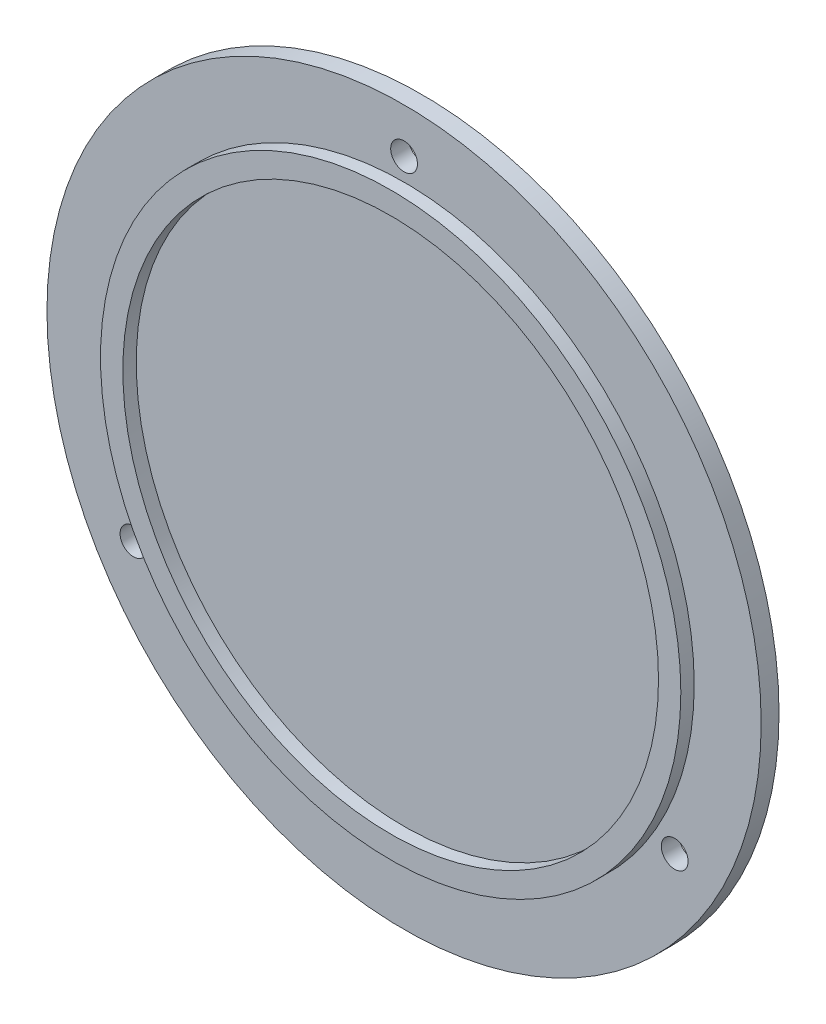
ISO-10303-21;
HEADER;
FILE_DESCRIPTION(('STEP AP214'),'2;1');
FILE_NAME('part.step','',(''),(''),'','','');
FILE_SCHEMA(('AUTOMOTIVE_DESIGN { 1 0 10303 214 1 1 1 1 }'));
ENDSEC;
DATA;
#1=APPLICATION_CONTEXT('core data for automotive mechanical design processes');
#2=APPLICATION_PROTOCOL_DEFINITION('international standard','automotive_design',2000,#1);
#3=PRODUCT_CONTEXT('',#1,'mechanical');
#4=PRODUCT('Part','Part','',(#3));
#5=PRODUCT_RELATED_PRODUCT_CATEGORY('part','',(#4));
#6=PRODUCT_DEFINITION_FORMATION('','',#4);
#7=PRODUCT_DEFINITION_CONTEXT('part definition',#1,'design');
#8=PRODUCT_DEFINITION('design','',#6,#7);
#9=PRODUCT_DEFINITION_SHAPE('','',#8);
#10=(LENGTH_UNIT() NAMED_UNIT(*) SI_UNIT(.MILLI.,.METRE.));
#11=(NAMED_UNIT(*) PLANE_ANGLE_UNIT() SI_UNIT($,.RADIAN.));
#12=(NAMED_UNIT(*) SI_UNIT($,.STERADIAN.) SOLID_ANGLE_UNIT());
#13=UNCERTAINTY_MEASURE_WITH_UNIT(LENGTH_MEASURE(1.E-05),#10,'distance_accuracy_value','');
#14=(GEOMETRIC_REPRESENTATION_CONTEXT(3) GLOBAL_UNCERTAINTY_ASSIGNED_CONTEXT((#13)) GLOBAL_UNIT_ASSIGNED_CONTEXT((#10,
#11,#12)) REPRESENTATION_CONTEXT('',''));
#15=CARTESIAN_POINT('',(0.,0.,0.));
#16=DIRECTION('',(0.,0.,1.));
#17=DIRECTION('',(1.,0.,0.));
#18=AXIS2_PLACEMENT_3D('',#15,#16,#17);
#19=CARTESIAN_POINT('',(0.,0.,4.));
#20=DIRECTION('',(0.,0.,-1.));
#21=DIRECTION('',(-1.,0.,0.));
#22=AXIS2_PLACEMENT_3D('',#19,#20,#21);
#23=CYLINDRICAL_SURFACE('',#22,80.);
#24=CARTESIAN_POINT('',(0.,0.,4.));
#25=DIRECTION('',(0.,0.,1.));
#26=DIRECTION('',(1.,0.,0.));
#27=AXIS2_PLACEMENT_3D('',#24,#25,#26);
#28=CIRCLE('',#27,80.);
#29=CARTESIAN_POINT('',(80.,0.,4.));
#30=VERTEX_POINT('',#29);
#31=EDGE_CURVE('E44',#30,#30,#28,.T.);
#32=ORIENTED_EDGE('',*,*,#31,.F.);
#33=EDGE_LOOP('',(#32));
#34=FACE_BOUND('',#33,.T.);
#35=CARTESIAN_POINT('',(0.,0.,0.));
#36=DIRECTION('',(0.,0.,1.));
#37=DIRECTION('',(1.,0.,0.));
#38=AXIS2_PLACEMENT_3D('',#35,#36,#37);
#39=CIRCLE('',#38,80.);
#40=CARTESIAN_POINT('',(80.,0.,0.));
#41=VERTEX_POINT('',#40);
#42=EDGE_CURVE('E49',#41,#41,#39,.T.);
#43=ORIENTED_EDGE('',*,*,#42,.T.);
#44=EDGE_LOOP('',(#43));
#45=FACE_BOUND('',#44,.T.);
#46=ADVANCED_FACE('F37',(#34,#45),#23,.T.);
#47=CARTESIAN_POINT('',(0.,0.,4.));
#48=DIRECTION('',(0.,0.,1.));
#49=DIRECTION('',(1.,0.,0.));
#50=AXIS2_PLACEMENT_3D('',#47,#48,#49);
#51=PLANE('',#50);
#52=CARTESIAN_POINT('',(0.,70.,4.));
#53=DIRECTION('',(0.,0.,1.));
#54=DIRECTION('',(1.,0.,0.));
#55=AXIS2_PLACEMENT_3D('',#52,#53,#54);
#56=CIRCLE('',#55,3.);
#57=CARTESIAN_POINT('',(3.,70.,4.));
#58=VERTEX_POINT('',#57);
#59=EDGE_CURVE('E68',#58,#58,#56,.T.);
#60=ORIENTED_EDGE('',*,*,#59,.F.);
#61=EDGE_LOOP('',(#60));
#62=FACE_BOUND('',#61,.T.);
#63=CARTESIAN_POINT('',(60.6217782649063,-35.0000000000026,4.));
#64=DIRECTION('',(0.,0.,1.));
#65=DIRECTION('',(1.,0.,0.));
#66=AXIS2_PLACEMENT_3D('',#63,#64,#65);
#67=CIRCLE('',#66,3.00000000000565);
#68=CARTESIAN_POINT('',(63.6217782649119,-35.0000000000026,4.));
#69=VERTEX_POINT('',#68);
#70=EDGE_CURVE('E72',#69,#69,#67,.T.);
#71=ORIENTED_EDGE('',*,*,#70,.F.);
#72=EDGE_LOOP('',(#71));
#73=FACE_BOUND('',#72,.T.);
#74=CARTESIAN_POINT('',(-60.6217782649152,-34.9999999999974,4.));
#75=DIRECTION('',(0.,0.,1.));
#76=DIRECTION('',(1.,0.,0.));
#77=AXIS2_PLACEMENT_3D('',#74,#75,#76);
#78=CIRCLE('',#77,3.00000000000388);
#79=CARTESIAN_POINT('',(-57.6217782649113,-34.9999999999974,4.));
#80=VERTEX_POINT('',#79);
#81=EDGE_CURVE('E76',#80,#80,#78,.T.);
#82=ORIENTED_EDGE('',*,*,#81,.F.);
#83=EDGE_LOOP('',(#82));
#84=FACE_BOUND('',#83,.T.);
#85=CARTESIAN_POINT('',(0.,0.,4.));
#86=DIRECTION('',(0.,0.,1.));
#87=DIRECTION('',(1.,0.,0.));
#88=AXIS2_PLACEMENT_3D('',#85,#86,#87);
#89=CIRCLE('',#88,65.);
#90=CARTESIAN_POINT('',(65.,0.,4.));
#91=VERTEX_POINT('',#90);
#92=EDGE_CURVE('E57',#91,#91,#89,.T.);
#93=ORIENTED_EDGE('',*,*,#92,.F.);
#94=EDGE_LOOP('',(#93));
#95=FACE_BOUND('',#94,.T.);
#96=ORIENTED_EDGE('',*,*,#31,.T.);
#97=EDGE_LOOP('',(#96));
#98=FACE_BOUND('',#97,.T.);
#99=ADVANCED_FACE('F99',(#62,#73,#84,#95,#98),#51,.T.);
#100=CARTESIAN_POINT('',(0.,0.,0.));
#101=DIRECTION('',(0.,0.,1.));
#102=DIRECTION('',(1.,0.,0.));
#103=AXIS2_PLACEMENT_3D('',#100,#101,#102);
#104=PLANE('',#103);
#105=CARTESIAN_POINT('',(0.,70.,0.));
#106=DIRECTION('',(0.,0.,-1.));
#107=DIRECTION('',(-1.,0.,0.));
#108=AXIS2_PLACEMENT_3D('',#105,#106,#107);
#109=CIRCLE('',#108,3.);
#110=CARTESIAN_POINT('',(-3.,70.,0.));
#111=VERTEX_POINT('',#110);
#112=EDGE_CURVE('E80',#111,#111,#109,.T.);
#113=ORIENTED_EDGE('',*,*,#112,.F.);
#114=EDGE_LOOP('',(#113));
#115=FACE_BOUND('',#114,.T.);
#116=CARTESIAN_POINT('',(60.6217782649063,-35.0000000000026,0.));
#117=DIRECTION('',(0.,0.,-1.));
#118=DIRECTION('',(-1.,0.,0.));
#119=AXIS2_PLACEMENT_3D('',#116,#117,#118);
#120=CIRCLE('',#119,3.00000000000565);
#121=CARTESIAN_POINT('',(57.6217782649006,-35.0000000000026,0.));
#122=VERTEX_POINT('',#121);
#123=EDGE_CURVE('E85',#122,#122,#120,.T.);
#124=ORIENTED_EDGE('',*,*,#123,.F.);
#125=EDGE_LOOP('',(#124));
#126=FACE_BOUND('',#125,.T.);
#127=CARTESIAN_POINT('',(-60.6217782649152,-34.9999999999974,0.));
#128=DIRECTION('',(0.,0.,-1.));
#129=DIRECTION('',(-1.,0.,0.));
#130=AXIS2_PLACEMENT_3D('',#127,#128,#129);
#131=CIRCLE('',#130,3.00000000000388);
#132=CARTESIAN_POINT('',(-63.6217782649191,-34.9999999999974,0.));
#133=VERTEX_POINT('',#132);
#134=EDGE_CURVE('E81',#133,#133,#131,.T.);
#135=ORIENTED_EDGE('',*,*,#134,.F.);
#136=EDGE_LOOP('',(#135));
#137=FACE_BOUND('',#136,.T.);
#138=ORIENTED_EDGE('',*,*,#42,.F.);
#139=EDGE_LOOP('',(#138));
#140=FACE_BOUND('',#139,.T.);
#141=ADVANCED_FACE('F95',(#115,#126,#137,#140),#104,.F.);
#142=CARTESIAN_POINT('',(0.,0.,7.));
#143=DIRECTION('',(0.,0.,1.));
#144=DIRECTION('',(1.,0.,0.));
#145=AXIS2_PLACEMENT_3D('',#142,#143,#144);
#146=PLANE('',#145);
#147=CARTESIAN_POINT('',(0.,0.,7.));
#148=DIRECTION('',(0.,0.,1.));
#149=DIRECTION('',(1.,0.,0.));
#150=AXIS2_PLACEMENT_3D('',#147,#148,#149);
#151=CIRCLE('',#150,65.);
#152=CARTESIAN_POINT('',(65.,0.,7.));
#153=VERTEX_POINT('',#152);
#154=EDGE_CURVE('E55',#153,#153,#151,.T.);
#155=ORIENTED_EDGE('',*,*,#154,.T.);
#156=EDGE_LOOP('',(#155));
#157=FACE_BOUND('',#156,.T.);
#158=CARTESIAN_POINT('',(0.,0.,7.));
#159=DIRECTION('',(0.,0.,1.));
#160=DIRECTION('',(1.,0.,0.));
#161=AXIS2_PLACEMENT_3D('',#158,#159,#160);
#162=CIRCLE('',#161,60.);
#163=CARTESIAN_POINT('',(60.,0.,7.));
#164=VERTEX_POINT('',#163);
#165=EDGE_CURVE('E61',#164,#164,#162,.T.);
#166=ORIENTED_EDGE('',*,*,#165,.F.);
#167=EDGE_LOOP('',(#166));
#168=FACE_BOUND('',#167,.T.);
#169=ADVANCED_FACE('F98',(#157,#168),#146,.T.);
#170=CARTESIAN_POINT('',(0.,0.,7.));
#171=DIRECTION('',(0.,0.,-1.));
#172=DIRECTION('',(-1.,0.,0.));
#173=AXIS2_PLACEMENT_3D('',#170,#171,#172);
#174=CYLINDRICAL_SURFACE('',#173,65.);
#175=ORIENTED_EDGE('',*,*,#154,.F.);
#176=EDGE_LOOP('',(#175));
#177=FACE_BOUND('',#176,.T.);
#178=ORIENTED_EDGE('',*,*,#92,.T.);
#179=EDGE_LOOP('',(#178));
#180=FACE_BOUND('',#179,.T.);
#181=ADVANCED_FACE('F130',(#177,#180),#174,.T.);
#182=CARTESIAN_POINT('',(0.,0.,7.));
#183=DIRECTION('',(0.,0.,-1.));
#184=DIRECTION('',(-1.,0.,0.));
#185=AXIS2_PLACEMENT_3D('',#182,#183,#184);
#186=CYLINDRICAL_SURFACE('',#185,60.);
#187=ORIENTED_EDGE('',*,*,#165,.T.);
#188=EDGE_LOOP('',(#187));
#189=FACE_BOUND('',#188,.T.);
#190=CARTESIAN_POINT('',(0.,0.,4.));
#191=DIRECTION('',(0.,0.,1.));
#192=DIRECTION('',(1.,0.,0.));
#193=AXIS2_PLACEMENT_3D('',#190,#191,#192);
#194=CIRCLE('',#193,60.);
#195=CARTESIAN_POINT('',(60.,0.,4.));
#196=VERTEX_POINT('',#195);
#197=EDGE_CURVE('E10',#196,#196,#194,.F.);
#198=ORIENTED_EDGE('',*,*,#197,.T.);
#199=EDGE_LOOP('',(#198));
#200=FACE_BOUND('',#199,.T.);
#201=ADVANCED_FACE('F121',(#189,#200),#186,.F.);
#202=ORIENTED_EDGE('',*,*,#197,.F.);
#203=EDGE_LOOP('',(#202));
#204=FACE_BOUND('',#203,.T.);
#205=ADVANCED_FACE('F113',(#204),#51,.T.);
#206=CARTESIAN_POINT('',(-60.6217782649152,-34.9999999999974,7.));
#207=DIRECTION('',(0.,0.,-1.));
#208=DIRECTION('',(-1.,0.,0.));
#209=AXIS2_PLACEMENT_3D('',#206,#207,#208);
#210=CYLINDRICAL_SURFACE('',#209,3.00000000000388);
#211=ORIENTED_EDGE('',*,*,#81,.T.);
#212=EDGE_LOOP('',(#211));
#213=FACE_BOUND('',#212,.T.);
#214=ORIENTED_EDGE('',*,*,#134,.T.);
#215=EDGE_LOOP('',(#214));
#216=FACE_BOUND('',#215,.T.);
#217=ADVANCED_FACE('F120',(#213,#216),#210,.F.);
#218=CARTESIAN_POINT('',(60.6217782649063,-35.0000000000026,7.));
#219=DIRECTION('',(0.,0.,-1.));
#220=DIRECTION('',(-1.,0.,0.));
#221=AXIS2_PLACEMENT_3D('',#218,#219,#220);
#222=CYLINDRICAL_SURFACE('',#221,3.00000000000565);
#223=ORIENTED_EDGE('',*,*,#70,.T.);
#224=EDGE_LOOP('',(#223));
#225=FACE_BOUND('',#224,.T.);
#226=ORIENTED_EDGE('',*,*,#123,.T.);
#227=EDGE_LOOP('',(#226));
#228=FACE_BOUND('',#227,.T.);
#229=ADVANCED_FACE('F127',(#225,#228),#222,.F.);
#230=CARTESIAN_POINT('',(0.,70.,7.));
#231=DIRECTION('',(0.,0.,-1.));
#232=DIRECTION('',(-1.,0.,0.));
#233=AXIS2_PLACEMENT_3D('',#230,#231,#232);
#234=CYLINDRICAL_SURFACE('',#233,3.);
#235=ORIENTED_EDGE('',*,*,#59,.T.);
#236=EDGE_LOOP('',(#235));
#237=FACE_BOUND('',#236,.T.);
#238=ORIENTED_EDGE('',*,*,#112,.T.);
#239=EDGE_LOOP('',(#238));
#240=FACE_BOUND('',#239,.T.);
#241=ADVANCED_FACE('F93',(#237,#240),#234,.F.);
#242=CLOSED_SHELL('',(#46,#99,#141,#169,#181,#201,#205,#217,#229,#241));
#243=MANIFOLD_SOLID_BREP('B2',#242);
#244=ADVANCED_BREP_SHAPE_REPRESENTATION('',(#18,#243),#14);
#245=SHAPE_DEFINITION_REPRESENTATION(#9,#244);
ENDSEC;
END-ISO-10303-21;
